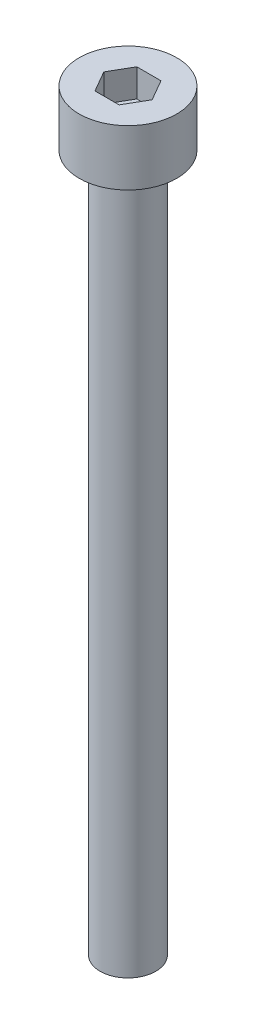
ISO-10303-21;
HEADER;
FILE_DESCRIPTION(('STEP AP214'),'2;1');
FILE_NAME('part.step','',(''),(''),'','','');
FILE_SCHEMA(('AUTOMOTIVE_DESIGN { 1 0 10303 214 1 1 1 1 }'));
ENDSEC;
DATA;
#1=APPLICATION_CONTEXT('core data for automotive mechanical design processes');
#2=APPLICATION_PROTOCOL_DEFINITION('international standard','automotive_design',2000,#1);
#3=PRODUCT_CONTEXT('',#1,'mechanical');
#4=PRODUCT('Part','Part','',(#3));
#5=PRODUCT_RELATED_PRODUCT_CATEGORY('part','',(#4));
#6=PRODUCT_DEFINITION_FORMATION('','',#4);
#7=PRODUCT_DEFINITION_CONTEXT('part definition',#1,'design');
#8=PRODUCT_DEFINITION('design','',#6,#7);
#9=PRODUCT_DEFINITION_SHAPE('','',#8);
#10=(LENGTH_UNIT() NAMED_UNIT(*) SI_UNIT(.MILLI.,.METRE.));
#11=(NAMED_UNIT(*) PLANE_ANGLE_UNIT() SI_UNIT($,.RADIAN.));
#12=(NAMED_UNIT(*) SI_UNIT($,.STERADIAN.) SOLID_ANGLE_UNIT());
#13=UNCERTAINTY_MEASURE_WITH_UNIT(LENGTH_MEASURE(1.E-05),#10,'distance_accuracy_value','');
#14=(GEOMETRIC_REPRESENTATION_CONTEXT(3) GLOBAL_UNCERTAINTY_ASSIGNED_CONTEXT((#13)) GLOBAL_UNIT_ASSIGNED_CONTEXT((#10,
#11,#12)) REPRESENTATION_CONTEXT('',''));
#15=CARTESIAN_POINT('',(0.,0.,0.));
#16=DIRECTION('',(0.,0.,1.));
#17=DIRECTION('',(1.,0.,0.));
#18=AXIS2_PLACEMENT_3D('',#15,#16,#17);
#19=CARTESIAN_POINT('',(0.,4.,0.));
#20=DIRECTION('',(0.,-1.,0.));
#21=DIRECTION('',(0.,0.,-1.));
#22=AXIS2_PLACEMENT_3D('',#19,#20,#21);
#23=CYLINDRICAL_SURFACE('',#22,3.5);
#24=CARTESIAN_POINT('',(0.,4.,0.));
#25=DIRECTION('',(0.,1.,0.));
#26=DIRECTION('',(0.,0.,1.));
#27=AXIS2_PLACEMENT_3D('',#24,#25,#26);
#28=CIRCLE('',#27,3.5);
#29=CARTESIAN_POINT('',(0.,4.,3.5));
#30=VERTEX_POINT('',#29);
#31=EDGE_CURVE('E43',#30,#30,#28,.T.);
#32=ORIENTED_EDGE('',*,*,#31,.F.);
#33=EDGE_LOOP('',(#32));
#34=FACE_BOUND('',#33,.T.);
#35=CARTESIAN_POINT('',(0.,0.,0.));
#36=DIRECTION('',(0.,1.,0.));
#37=DIRECTION('',(0.,0.,1.));
#38=AXIS2_PLACEMENT_3D('',#35,#36,#37);
#39=CIRCLE('',#38,3.5);
#40=CARTESIAN_POINT('',(0.,0.,3.5));
#41=VERTEX_POINT('',#40);
#42=EDGE_CURVE('E38',#41,#41,#39,.T.);
#43=ORIENTED_EDGE('',*,*,#42,.T.);
#44=EDGE_LOOP('',(#43));
#45=FACE_BOUND('',#44,.T.);
#46=ADVANCED_FACE('F35',(#34,#45),#23,.T.);
#47=CARTESIAN_POINT('',(0.,4.,0.));
#48=DIRECTION('',(0.,1.,0.));
#49=DIRECTION('',(0.,0.,1.));
#50=AXIS2_PLACEMENT_3D('',#47,#48,#49);
#51=PLANE('',#50);
#52=DIRECTION('',(0.5,0.,-0.866025403784439));
#53=VECTOR('',#52,1.);
#54=CARTESIAN_POINT('',(0.866025403784438,4.,1.5));
#55=LINE('',#54,#53);
#56=CARTESIAN_POINT('',(0.866025403784438,4.,1.5));
#57=VERTEX_POINT('',#56);
#58=CARTESIAN_POINT('',(1.73205080756888,4.,0.));
#59=VERTEX_POINT('',#58);
#60=EDGE_CURVE('E51',#57,#59,#55,.T.);
#61=ORIENTED_EDGE('',*,*,#60,.F.);
#62=DIRECTION('',(1.,0.,0.));
#63=VECTOR('',#62,1.);
#64=CARTESIAN_POINT('',(-0.866025403784439,4.,1.5));
#65=LINE('',#64,#63);
#66=CARTESIAN_POINT('',(-0.866025403784439,4.,1.5));
#67=VERTEX_POINT('',#66);
#68=EDGE_CURVE('E135',#67,#57,#65,.T.);
#69=ORIENTED_EDGE('',*,*,#68,.F.);
#70=DIRECTION('',(0.5,0.,0.866025403784438));
#71=VECTOR('',#70,1.);
#72=CARTESIAN_POINT('',(-1.73205080756888,4.,0.));
#73=LINE('',#72,#71);
#74=CARTESIAN_POINT('',(-1.73205080756888,4.,0.));
#75=VERTEX_POINT('',#74);
#76=EDGE_CURVE('E133',#75,#67,#73,.T.);
#77=ORIENTED_EDGE('',*,*,#76,.F.);
#78=DIRECTION('',(-0.5,0.,0.866025403784439));
#79=VECTOR('',#78,1.);
#80=CARTESIAN_POINT('',(-0.866025403784439,4.,-1.5));
#81=LINE('',#80,#79);
#82=CARTESIAN_POINT('',(-0.866025403784439,4.,-1.5));
#83=VERTEX_POINT('',#82);
#84=EDGE_CURVE('E99',#83,#75,#81,.T.);
#85=ORIENTED_EDGE('',*,*,#84,.F.);
#86=DIRECTION('',(-1.,0.,0.));
#87=VECTOR('',#86,1.);
#88=CARTESIAN_POINT('',(0.866025403784438,4.,-1.5));
#89=LINE('',#88,#87);
#90=CARTESIAN_POINT('',(0.866025403784438,4.,-1.5));
#91=VERTEX_POINT('',#90);
#92=EDGE_CURVE('E129',#91,#83,#89,.T.);
#93=ORIENTED_EDGE('',*,*,#92,.F.);
#94=DIRECTION('',(-0.5,0.,-0.866025403784439));
#95=VECTOR('',#94,1.);
#96=CARTESIAN_POINT('',(1.73205080756888,4.,0.));
#97=LINE('',#96,#95);
#98=EDGE_CURVE('E125',#59,#91,#97,.T.);
#99=ORIENTED_EDGE('',*,*,#98,.F.);
#100=EDGE_LOOP('',(#61,#69,#77,#85,#93,#99));
#101=FACE_BOUND('',#100,.T.);
#102=ORIENTED_EDGE('',*,*,#31,.T.);
#103=EDGE_LOOP('',(#102));
#104=FACE_BOUND('',#103,.T.);
#105=ADVANCED_FACE('F153',(#101,#104),#51,.T.);
#106=CARTESIAN_POINT('',(0.,0.,0.));
#107=DIRECTION('',(0.,1.,0.));
#108=DIRECTION('',(0.,0.,1.));
#109=AXIS2_PLACEMENT_3D('',#106,#107,#108);
#110=PLANE('',#109);
#111=CARTESIAN_POINT('',(0.,0.,0.));
#112=DIRECTION('',(0.,-1.,0.));
#113=DIRECTION('',(0.,0.,-1.));
#114=AXIS2_PLACEMENT_3D('',#111,#112,#113);
#115=CIRCLE('',#114,2.);
#116=CARTESIAN_POINT('',(0.,0.,-2.));
#117=VERTEX_POINT('',#116);
#118=EDGE_CURVE('E11',#117,#117,#115,.T.);
#119=ORIENTED_EDGE('',*,*,#118,.F.);
#120=EDGE_LOOP('',(#119));
#121=FACE_BOUND('',#120,.T.);
#122=ORIENTED_EDGE('',*,*,#42,.F.);
#123=EDGE_LOOP('',(#122));
#124=FACE_BOUND('',#123,.T.);
#125=ADVANCED_FACE('F150',(#121,#124),#110,.F.);
#126=CARTESIAN_POINT('',(0.866025403784438,2.,1.5));
#127=DIRECTION('',(0.866025403784439,0.,0.5));
#128=DIRECTION('',(0.5,0.,-0.866025403784439));
#129=AXIS2_PLACEMENT_3D('',#126,#127,#128);
#130=PLANE('',#129);
#131=ORIENTED_EDGE('',*,*,#60,.T.);
#132=DIRECTION('',(0.,1.,0.));
#133=VECTOR('',#132,1.);
#134=CARTESIAN_POINT('',(1.73205080756888,2.,0.));
#135=LINE('',#134,#133);
#136=CARTESIAN_POINT('',(1.73205080756888,2.,0.));
#137=VERTEX_POINT('',#136);
#138=EDGE_CURVE('E81',#137,#59,#135,.T.);
#139=ORIENTED_EDGE('',*,*,#138,.F.);
#140=DIRECTION('',(0.5,0.,-0.866025403784439));
#141=VECTOR('',#140,1.);
#142=CARTESIAN_POINT('',(0.866025403784438,2.,1.5));
#143=LINE('',#142,#141);
#144=CARTESIAN_POINT('',(0.866025403784438,2.,1.5));
#145=VERTEX_POINT('',#144);
#146=EDGE_CURVE('E137',#145,#137,#143,.T.);
#147=ORIENTED_EDGE('',*,*,#146,.F.);
#148=DIRECTION('',(0.,1.,0.));
#149=VECTOR('',#148,1.);
#150=CARTESIAN_POINT('',(0.866025403784438,2.,1.5));
#151=LINE('',#150,#149);
#152=EDGE_CURVE('E59',#145,#57,#151,.T.);
#153=ORIENTED_EDGE('',*,*,#152,.T.);
#154=EDGE_LOOP('',(#131,#139,#147,#153));
#155=FACE_BOUND('',#154,.T.);
#156=ADVANCED_FACE('F152',(#155),#130,.F.);
#157=CARTESIAN_POINT('',(-0.866025403784439,2.,1.5));
#158=DIRECTION('',(0.,0.,1.));
#159=DIRECTION('',(1.,0.,0.));
#160=AXIS2_PLACEMENT_3D('',#157,#158,#159);
#161=PLANE('',#160);
#162=ORIENTED_EDGE('',*,*,#68,.T.);
#163=ORIENTED_EDGE('',*,*,#152,.F.);
#164=DIRECTION('',(1.,0.,0.));
#165=VECTOR('',#164,1.);
#166=CARTESIAN_POINT('',(-0.866025403784439,2.,1.5));
#167=LINE('',#166,#165);
#168=CARTESIAN_POINT('',(-0.866025403784439,2.,1.5));
#169=VERTEX_POINT('',#168);
#170=EDGE_CURVE('E111',#169,#145,#167,.T.);
#171=ORIENTED_EDGE('',*,*,#170,.F.);
#172=DIRECTION('',(0.,1.,0.));
#173=VECTOR('',#172,1.);
#174=CARTESIAN_POINT('',(-0.866025403784439,2.,1.5));
#175=LINE('',#174,#173);
#176=EDGE_CURVE('E103',#169,#67,#175,.T.);
#177=ORIENTED_EDGE('',*,*,#176,.T.);
#178=EDGE_LOOP('',(#162,#163,#171,#177));
#179=FACE_BOUND('',#178,.T.);
#180=ADVANCED_FACE('F159',(#179),#161,.F.);
#181=CARTESIAN_POINT('',(-1.73205080756888,2.,0.));
#182=DIRECTION('',(-0.866025403784439,0.,0.5));
#183=DIRECTION('',(0.5,0.,0.866025403784438));
#184=AXIS2_PLACEMENT_3D('',#181,#182,#183);
#185=PLANE('',#184);
#186=ORIENTED_EDGE('',*,*,#76,.T.);
#187=ORIENTED_EDGE('',*,*,#176,.F.);
#188=DIRECTION('',(0.5,0.,0.866025403784438));
#189=VECTOR('',#188,1.);
#190=CARTESIAN_POINT('',(-1.73205080756888,2.,0.));
#191=LINE('',#190,#189);
#192=CARTESIAN_POINT('',(-1.73205080756888,2.,0.));
#193=VERTEX_POINT('',#192);
#194=EDGE_CURVE('E107',#193,#169,#191,.T.);
#195=ORIENTED_EDGE('',*,*,#194,.F.);
#196=DIRECTION('',(0.,1.,0.));
#197=VECTOR('',#196,1.);
#198=CARTESIAN_POINT('',(-1.73205080756888,2.,0.));
#199=LINE('',#198,#197);
#200=EDGE_CURVE('E92',#193,#75,#199,.T.);
#201=ORIENTED_EDGE('',*,*,#200,.T.);
#202=EDGE_LOOP('',(#186,#187,#195,#201));
#203=FACE_BOUND('',#202,.T.);
#204=ADVANCED_FACE('F108',(#203),#185,.F.);
#205=CARTESIAN_POINT('',(-0.866025403784439,2.,-1.5));
#206=DIRECTION('',(-0.866025403784439,0.,-0.5));
#207=DIRECTION('',(-0.5,0.,0.866025403784439));
#208=AXIS2_PLACEMENT_3D('',#205,#206,#207);
#209=PLANE('',#208);
#210=ORIENTED_EDGE('',*,*,#84,.T.);
#211=ORIENTED_EDGE('',*,*,#200,.F.);
#212=DIRECTION('',(-0.5,0.,0.866025403784439));
#213=VECTOR('',#212,1.);
#214=CARTESIAN_POINT('',(-0.866025403784439,2.,-1.5));
#215=LINE('',#214,#213);
#216=CARTESIAN_POINT('',(-0.866025403784439,2.,-1.5));
#217=VERTEX_POINT('',#216);
#218=EDGE_CURVE('E96',#217,#193,#215,.T.);
#219=ORIENTED_EDGE('',*,*,#218,.F.);
#220=DIRECTION('',(0.,1.,0.));
#221=VECTOR('',#220,1.);
#222=CARTESIAN_POINT('',(-0.866025403784439,2.,-1.5));
#223=LINE('',#222,#221);
#224=EDGE_CURVE('E104',#217,#83,#223,.T.);
#225=ORIENTED_EDGE('',*,*,#224,.T.);
#226=EDGE_LOOP('',(#210,#211,#219,#225));
#227=FACE_BOUND('',#226,.T.);
#228=ADVANCED_FACE('F94',(#227),#209,.F.);
#229=CARTESIAN_POINT('',(0.866025403784438,2.,-1.5));
#230=DIRECTION('',(0.,0.,-1.));
#231=DIRECTION('',(-1.,0.,0.));
#232=AXIS2_PLACEMENT_3D('',#229,#230,#231);
#233=PLANE('',#232);
#234=ORIENTED_EDGE('',*,*,#92,.T.);
#235=ORIENTED_EDGE('',*,*,#224,.F.);
#236=DIRECTION('',(-1.,0.,0.));
#237=VECTOR('',#236,1.);
#238=CARTESIAN_POINT('',(0.866025403784438,2.,-1.5));
#239=LINE('',#238,#237);
#240=CARTESIAN_POINT('',(0.866025403784438,2.,-1.5));
#241=VERTEX_POINT('',#240);
#242=EDGE_CURVE('E117',#241,#217,#239,.T.);
#243=ORIENTED_EDGE('',*,*,#242,.F.);
#244=DIRECTION('',(0.,1.,0.));
#245=VECTOR('',#244,1.);
#246=CARTESIAN_POINT('',(0.866025403784438,2.,-1.5));
#247=LINE('',#246,#245);
#248=EDGE_CURVE('E141',#241,#91,#247,.T.);
#249=ORIENTED_EDGE('',*,*,#248,.T.);
#250=EDGE_LOOP('',(#234,#235,#243,#249));
#251=FACE_BOUND('',#250,.T.);
#252=ADVANCED_FACE('F204',(#251),#233,.F.);
#253=CARTESIAN_POINT('',(1.73205080756888,2.,0.));
#254=DIRECTION('',(0.866025403784439,0.,-0.5));
#255=DIRECTION('',(-0.5,0.,-0.866025403784439));
#256=AXIS2_PLACEMENT_3D('',#253,#254,#255);
#257=PLANE('',#256);
#258=ORIENTED_EDGE('',*,*,#98,.T.);
#259=ORIENTED_EDGE('',*,*,#248,.F.);
#260=DIRECTION('',(-0.5,0.,-0.866025403784439));
#261=VECTOR('',#260,1.);
#262=CARTESIAN_POINT('',(1.73205080756888,2.,0.));
#263=LINE('',#262,#261);
#264=EDGE_CURVE('E119',#137,#241,#263,.T.);
#265=ORIENTED_EDGE('',*,*,#264,.F.);
#266=ORIENTED_EDGE('',*,*,#138,.T.);
#267=EDGE_LOOP('',(#258,#259,#265,#266));
#268=FACE_BOUND('',#267,.T.);
#269=ADVANCED_FACE('F213',(#268),#257,.F.);
#270=CARTESIAN_POINT('',(0.,2.,0.));
#271=DIRECTION('',(0.,1.,0.));
#272=DIRECTION('',(0.,0.,1.));
#273=AXIS2_PLACEMENT_3D('',#270,#271,#272);
#274=PLANE('',#273);
#275=ORIENTED_EDGE('',*,*,#146,.T.);
#276=ORIENTED_EDGE('',*,*,#264,.T.);
#277=ORIENTED_EDGE('',*,*,#242,.T.);
#278=ORIENTED_EDGE('',*,*,#218,.T.);
#279=ORIENTED_EDGE('',*,*,#194,.T.);
#280=ORIENTED_EDGE('',*,*,#170,.T.);
#281=EDGE_LOOP('',(#275,#276,#277,#278,#279,#280));
#282=FACE_BOUND('',#281,.T.);
#283=ADVANCED_FACE('F114',(#282),#274,.T.);
#284=CARTESIAN_POINT('',(0.,-50.,0.));
#285=DIRECTION('',(0.,1.,0.));
#286=DIRECTION('',(0.,0.,1.));
#287=AXIS2_PLACEMENT_3D('',#284,#285,#286);
#288=CYLINDRICAL_SURFACE('',#287,2.);
#289=CARTESIAN_POINT('',(0.,-50.,0.));
#290=DIRECTION('',(0.,-1.,0.));
#291=DIRECTION('',(0.,0.,-1.));
#292=AXIS2_PLACEMENT_3D('',#289,#290,#291);
#293=CIRCLE('',#292,2.);
#294=CARTESIAN_POINT('',(0.,-50.,-2.));
#295=VERTEX_POINT('',#294);
#296=EDGE_CURVE('E126',#295,#295,#293,.T.);
#297=ORIENTED_EDGE('',*,*,#296,.F.);
#298=EDGE_LOOP('',(#297));
#299=FACE_BOUND('',#298,.T.);
#300=ORIENTED_EDGE('',*,*,#118,.T.);
#301=EDGE_LOOP('',(#300));
#302=FACE_BOUND('',#301,.T.);
#303=ADVANCED_FACE('F231',(#299,#302),#288,.T.);
#304=CARTESIAN_POINT('',(0.,-50.,0.));
#305=DIRECTION('',(0.,-1.,0.));
#306=DIRECTION('',(0.,0.,-1.));
#307=AXIS2_PLACEMENT_3D('',#304,#305,#306);
#308=PLANE('',#307);
#309=ORIENTED_EDGE('',*,*,#296,.T.);
#310=EDGE_LOOP('',(#309));
#311=FACE_BOUND('',#310,.T.);
#312=ADVANCED_FACE('F244',(#311),#308,.T.);
#313=CLOSED_SHELL('',(#46,#105,#125,#156,#180,#204,#228,#252,#269,#283,#303,#312));
#314=MANIFOLD_SOLID_BREP('B2',#313);
#315=ADVANCED_BREP_SHAPE_REPRESENTATION('',(#18,#314),#14);
#316=SHAPE_DEFINITION_REPRESENTATION(#9,#315);
ENDSEC;
END-ISO-10303-21;
